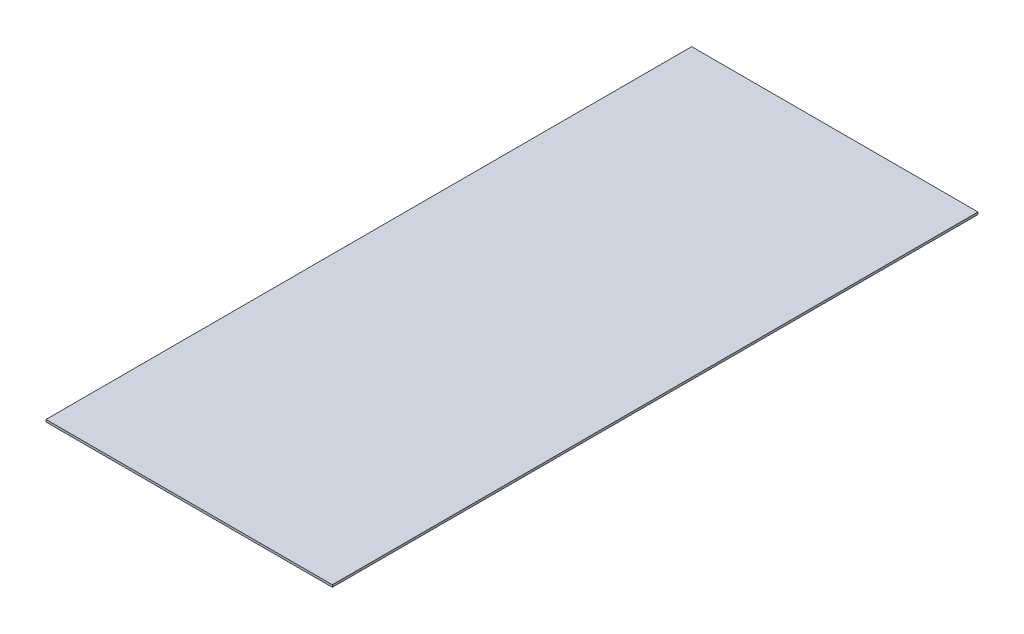
ISO-10303-21;
HEADER;
FILE_DESCRIPTION(('STEP AP214'),'2;1');
FILE_NAME('part.step','',(''),(''),'','','');
FILE_SCHEMA(('AUTOMOTIVE_DESIGN { 1 0 10303 214 1 1 1 1 }'));
ENDSEC;
DATA;
#1=APPLICATION_CONTEXT('core data for automotive mechanical design processes');
#2=APPLICATION_PROTOCOL_DEFINITION('international standard','automotive_design',2000,#1);
#3=PRODUCT_CONTEXT('',#1,'mechanical');
#4=PRODUCT('Part','Part','',(#3));
#5=PRODUCT_RELATED_PRODUCT_CATEGORY('part','',(#4));
#6=PRODUCT_DEFINITION_FORMATION('','',#4);
#7=PRODUCT_DEFINITION_CONTEXT('part definition',#1,'design');
#8=PRODUCT_DEFINITION('design','',#6,#7);
#9=PRODUCT_DEFINITION_SHAPE('','',#8);
#10=(LENGTH_UNIT() NAMED_UNIT(*) SI_UNIT(.MILLI.,.METRE.));
#11=(NAMED_UNIT(*) PLANE_ANGLE_UNIT() SI_UNIT($,.RADIAN.));
#12=(NAMED_UNIT(*) SI_UNIT($,.STERADIAN.) SOLID_ANGLE_UNIT());
#13=UNCERTAINTY_MEASURE_WITH_UNIT(LENGTH_MEASURE(1.E-05),#10,'distance_accuracy_value','');
#14=(GEOMETRIC_REPRESENTATION_CONTEXT(3) GLOBAL_UNCERTAINTY_ASSIGNED_CONTEXT((#13)) GLOBAL_UNIT_ASSIGNED_CONTEXT((#10,
#11,#12)) REPRESENTATION_CONTEXT('',''));
#15=CARTESIAN_POINT('',(0.,0.,0.));
#16=DIRECTION('',(0.,0.,1.));
#17=DIRECTION('',(1.,0.,0.));
#18=AXIS2_PLACEMENT_3D('',#15,#16,#17);
#19=CARTESIAN_POINT('',(161.925,1.27,-365.125));
#20=DIRECTION('',(-1.,0.,0.));
#21=DIRECTION('',(0.,0.,1.));
#22=AXIS2_PLACEMENT_3D('',#19,#20,#21);
#23=PLANE('',#22);
#24=DIRECTION('',(0.,0.,-1.));
#25=VECTOR('',#24,1.);
#26=CARTESIAN_POINT('',(161.925,-1.27,-365.125));
#27=LINE('',#26,#25);
#28=CARTESIAN_POINT('',(161.925,-1.27,365.125));
#29=VERTEX_POINT('',#28);
#30=CARTESIAN_POINT('',(161.925,-1.27,-365.125));
#31=VERTEX_POINT('',#30);
#32=EDGE_CURVE('E96',#29,#31,#27,.T.);
#33=ORIENTED_EDGE('',*,*,#32,.T.);
#34=DIRECTION('',(0.,-1.,0.));
#35=VECTOR('',#34,1.);
#36=CARTESIAN_POINT('',(161.925,1.27,-365.125));
#37=LINE('',#36,#35);
#38=CARTESIAN_POINT('',(161.925,1.27,-365.125));
#39=VERTEX_POINT('',#38);
#40=EDGE_CURVE('E11',#39,#31,#37,.T.);
#41=ORIENTED_EDGE('',*,*,#40,.F.);
#42=DIRECTION('',(0.,0.,-1.));
#43=VECTOR('',#42,1.);
#44=CARTESIAN_POINT('',(161.925,1.27,-365.125));
#45=LINE('',#44,#43);
#46=CARTESIAN_POINT('',(161.925,1.27,365.125));
#47=VERTEX_POINT('',#46);
#48=EDGE_CURVE('E84',#47,#39,#45,.T.);
#49=ORIENTED_EDGE('',*,*,#48,.F.);
#50=DIRECTION('',(0.,-1.,0.));
#51=VECTOR('',#50,1.);
#52=CARTESIAN_POINT('',(161.925,1.27,365.125));
#53=LINE('',#52,#51);
#54=EDGE_CURVE('E92',#47,#29,#53,.T.);
#55=ORIENTED_EDGE('',*,*,#54,.T.);
#56=EDGE_LOOP('',(#33,#41,#49,#55));
#57=FACE_BOUND('',#56,.T.);
#58=ADVANCED_FACE('F33',(#57),#23,.F.);
#59=CARTESIAN_POINT('',(-161.925,1.27,-365.125));
#60=DIRECTION('',(0.,0.,1.));
#61=DIRECTION('',(1.,0.,0.));
#62=AXIS2_PLACEMENT_3D('',#59,#60,#61);
#63=PLANE('',#62);
#64=DIRECTION('',(-1.,0.,0.));
#65=VECTOR('',#64,1.);
#66=CARTESIAN_POINT('',(-161.925,-1.27,-365.125));
#67=LINE('',#66,#65);
#68=CARTESIAN_POINT('',(-161.925,-1.27,-365.125));
#69=VERTEX_POINT('',#68);
#70=EDGE_CURVE('E88',#31,#69,#67,.T.);
#71=ORIENTED_EDGE('',*,*,#70,.T.);
#72=DIRECTION('',(0.,-1.,0.));
#73=VECTOR('',#72,1.);
#74=CARTESIAN_POINT('',(-161.925,1.27,-365.125));
#75=LINE('',#74,#73);
#76=CARTESIAN_POINT('',(-161.925,1.27,-365.125));
#77=VERTEX_POINT('',#76);
#78=EDGE_CURVE('E41',#77,#69,#75,.T.);
#79=ORIENTED_EDGE('',*,*,#78,.F.);
#80=DIRECTION('',(-1.,0.,0.));
#81=VECTOR('',#80,1.);
#82=CARTESIAN_POINT('',(-161.925,1.27,-365.125));
#83=LINE('',#82,#81);
#84=EDGE_CURVE('E79',#39,#77,#83,.T.);
#85=ORIENTED_EDGE('',*,*,#84,.F.);
#86=ORIENTED_EDGE('',*,*,#40,.T.);
#87=EDGE_LOOP('',(#71,#79,#85,#86));
#88=FACE_BOUND('',#87,.T.);
#89=ADVANCED_FACE('F87',(#88),#63,.F.);
#90=CARTESIAN_POINT('',(-161.925,1.27,-365.125));
#91=DIRECTION('',(1.,0.,0.));
#92=DIRECTION('',(0.,0.,-1.));
#93=AXIS2_PLACEMENT_3D('',#90,#91,#92);
#94=PLANE('',#93);
#95=DIRECTION('',(0.,0.,1.));
#96=VECTOR('',#95,1.);
#97=CARTESIAN_POINT('',(-161.925,-1.27,-365.125));
#98=LINE('',#97,#96);
#99=CARTESIAN_POINT('',(-161.925,-1.27,365.125));
#100=VERTEX_POINT('',#99);
#101=EDGE_CURVE('E66',#69,#100,#98,.T.);
#102=ORIENTED_EDGE('',*,*,#101,.T.);
#103=DIRECTION('',(0.,-1.,0.));
#104=VECTOR('',#103,1.);
#105=CARTESIAN_POINT('',(-161.925,1.27,365.125));
#106=LINE('',#105,#104);
#107=CARTESIAN_POINT('',(-161.925,1.27,365.125));
#108=VERTEX_POINT('',#107);
#109=EDGE_CURVE('E89',#108,#100,#106,.T.);
#110=ORIENTED_EDGE('',*,*,#109,.F.);
#111=DIRECTION('',(0.,0.,1.));
#112=VECTOR('',#111,1.);
#113=CARTESIAN_POINT('',(-161.925,1.27,-365.125));
#114=LINE('',#113,#112);
#115=EDGE_CURVE('E82',#77,#108,#114,.T.);
#116=ORIENTED_EDGE('',*,*,#115,.F.);
#117=ORIENTED_EDGE('',*,*,#78,.T.);
#118=EDGE_LOOP('',(#102,#110,#116,#117));
#119=FACE_BOUND('',#118,.T.);
#120=ADVANCED_FACE('F90',(#119),#94,.F.);
#121=CARTESIAN_POINT('',(-161.925,1.27,365.125));
#122=DIRECTION('',(0.,0.,-1.));
#123=DIRECTION('',(-1.,0.,0.));
#124=AXIS2_PLACEMENT_3D('',#121,#122,#123);
#125=PLANE('',#124);
#126=DIRECTION('',(1.,0.,0.));
#127=VECTOR('',#126,1.);
#128=CARTESIAN_POINT('',(-161.925,-1.27,365.125));
#129=LINE('',#128,#127);
#130=EDGE_CURVE('E72',#100,#29,#129,.T.);
#131=ORIENTED_EDGE('',*,*,#130,.T.);
#132=ORIENTED_EDGE('',*,*,#54,.F.);
#133=DIRECTION('',(1.,0.,0.));
#134=VECTOR('',#133,1.);
#135=CARTESIAN_POINT('',(-161.925,1.27,365.125));
#136=LINE('',#135,#134);
#137=EDGE_CURVE('E49',#108,#47,#136,.T.);
#138=ORIENTED_EDGE('',*,*,#137,.F.);
#139=ORIENTED_EDGE('',*,*,#109,.T.);
#140=EDGE_LOOP('',(#131,#132,#138,#139));
#141=FACE_BOUND('',#140,.T.);
#142=ADVANCED_FACE('F103',(#141),#125,.F.);
#143=CARTESIAN_POINT('',(0.,1.27,0.));
#144=DIRECTION('',(0.,1.,0.));
#145=DIRECTION('',(0.,0.,1.));
#146=AXIS2_PLACEMENT_3D('',#143,#144,#145);
#147=PLANE('',#146);
#148=ORIENTED_EDGE('',*,*,#48,.T.);
#149=ORIENTED_EDGE('',*,*,#84,.T.);
#150=ORIENTED_EDGE('',*,*,#115,.T.);
#151=ORIENTED_EDGE('',*,*,#137,.T.);
#152=EDGE_LOOP('',(#148,#149,#150,#151));
#153=FACE_BOUND('',#152,.T.);
#154=ADVANCED_FACE('F80',(#153),#147,.T.);
#155=CARTESIAN_POINT('',(0.,-1.27,0.));
#156=DIRECTION('',(0.,1.,0.));
#157=DIRECTION('',(0.,0.,1.));
#158=AXIS2_PLACEMENT_3D('',#155,#156,#157);
#159=PLANE('',#158);
#160=ORIENTED_EDGE('',*,*,#32,.F.);
#161=ORIENTED_EDGE('',*,*,#130,.F.);
#162=ORIENTED_EDGE('',*,*,#101,.F.);
#163=ORIENTED_EDGE('',*,*,#70,.F.);
#164=EDGE_LOOP('',(#160,#161,#162,#163));
#165=FACE_BOUND('',#164,.T.);
#166=ADVANCED_FACE('F106',(#165),#159,.F.);
#167=CLOSED_SHELL('',(#58,#89,#120,#142,#154,#166));
#168=MANIFOLD_SOLID_BREP('B2',#167);
#169=ADVANCED_BREP_SHAPE_REPRESENTATION('',(#18,#168),#14);
#170=SHAPE_DEFINITION_REPRESENTATION(#9,#169);
ENDSEC;
END-ISO-10303-21;
